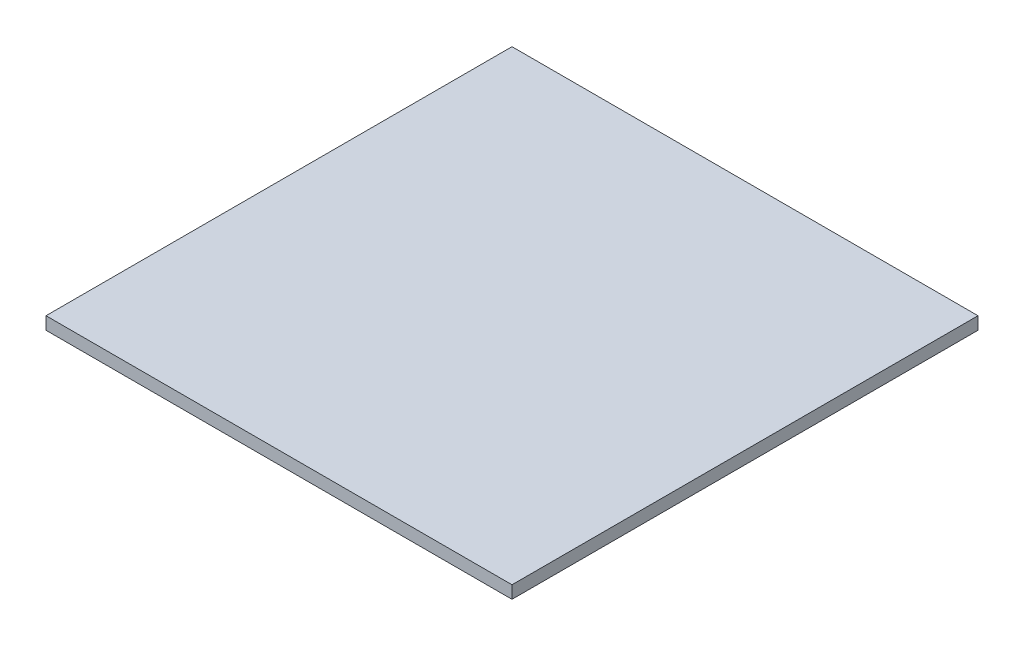
ISO-10303-21;
HEADER;
FILE_DESCRIPTION(('STEP AP214'),'2;1');
FILE_NAME('part.step','',(''),(''),'','','');
FILE_SCHEMA(('AUTOMOTIVE_DESIGN { 1 0 10303 214 1 1 1 1 }'));
ENDSEC;
DATA;
#1=APPLICATION_CONTEXT('core data for automotive mechanical design processes');
#2=APPLICATION_PROTOCOL_DEFINITION('international standard','automotive_design',2000,#1);
#3=PRODUCT_CONTEXT('',#1,'mechanical');
#4=PRODUCT('Part','Part','',(#3));
#5=PRODUCT_RELATED_PRODUCT_CATEGORY('part','',(#4));
#6=PRODUCT_DEFINITION_FORMATION('','',#4);
#7=PRODUCT_DEFINITION_CONTEXT('part definition',#1,'design');
#8=PRODUCT_DEFINITION('design','',#6,#7);
#9=PRODUCT_DEFINITION_SHAPE('','',#8);
#10=(LENGTH_UNIT() NAMED_UNIT(*) SI_UNIT(.MILLI.,.METRE.));
#11=(NAMED_UNIT(*) PLANE_ANGLE_UNIT() SI_UNIT($,.RADIAN.));
#12=(NAMED_UNIT(*) SI_UNIT($,.STERADIAN.) SOLID_ANGLE_UNIT());
#13=UNCERTAINTY_MEASURE_WITH_UNIT(LENGTH_MEASURE(1.E-05),#10,'distance_accuracy_value','');
#14=(GEOMETRIC_REPRESENTATION_CONTEXT(3) GLOBAL_UNCERTAINTY_ASSIGNED_CONTEXT((#13)) GLOBAL_UNIT_ASSIGNED_CONTEXT((#10,
#11,#12)) REPRESENTATION_CONTEXT('',''));
#15=CARTESIAN_POINT('',(0.,0.,0.));
#16=DIRECTION('',(0.,0.,1.));
#17=DIRECTION('',(1.,0.,0.));
#18=AXIS2_PLACEMENT_3D('',#15,#16,#17);
#19=CARTESIAN_POINT('',(-95.25,5.159375,-95.25));
#20=DIRECTION('',(1.,0.,0.));
#21=DIRECTION('',(0.,0.,-1.));
#22=AXIS2_PLACEMENT_3D('',#19,#20,#21);
#23=PLANE('',#22);
#24=DIRECTION('',(0.,0.,1.));
#25=VECTOR('',#24,1.);
#26=CARTESIAN_POINT('',(-95.25,0.,-95.25));
#27=LINE('',#26,#25);
#28=CARTESIAN_POINT('',(-95.25,0.,-95.25));
#29=VERTEX_POINT('',#28);
#30=CARTESIAN_POINT('',(-95.25,0.,95.25));
#31=VERTEX_POINT('',#30);
#32=EDGE_CURVE('E96',#29,#31,#27,.T.);
#33=ORIENTED_EDGE('',*,*,#32,.T.);
#34=DIRECTION('',(0.,-1.,0.));
#35=VECTOR('',#34,1.);
#36=CARTESIAN_POINT('',(-95.25,5.159375,95.25));
#37=LINE('',#36,#35);
#38=CARTESIAN_POINT('',(-95.25,5.159375,95.25));
#39=VERTEX_POINT('',#38);
#40=EDGE_CURVE('E11',#39,#31,#37,.T.);
#41=ORIENTED_EDGE('',*,*,#40,.F.);
#42=DIRECTION('',(0.,0.,1.));
#43=VECTOR('',#42,1.);
#44=CARTESIAN_POINT('',(-95.25,5.159375,-95.25));
#45=LINE('',#44,#43);
#46=CARTESIAN_POINT('',(-95.25,5.159375,-95.25));
#47=VERTEX_POINT('',#46);
#48=EDGE_CURVE('E84',#47,#39,#45,.T.);
#49=ORIENTED_EDGE('',*,*,#48,.F.);
#50=DIRECTION('',(0.,-1.,0.));
#51=VECTOR('',#50,1.);
#52=CARTESIAN_POINT('',(-95.25,5.159375,-95.25));
#53=LINE('',#52,#51);
#54=EDGE_CURVE('E92',#47,#29,#53,.T.);
#55=ORIENTED_EDGE('',*,*,#54,.T.);
#56=EDGE_LOOP('',(#33,#41,#49,#55));
#57=FACE_BOUND('',#56,.T.);
#58=ADVANCED_FACE('F33',(#57),#23,.F.);
#59=CARTESIAN_POINT('',(-95.25,5.159375,95.25));
#60=DIRECTION('',(0.,0.,-1.));
#61=DIRECTION('',(-1.,0.,0.));
#62=AXIS2_PLACEMENT_3D('',#59,#60,#61);
#63=PLANE('',#62);
#64=DIRECTION('',(1.,0.,0.));
#65=VECTOR('',#64,1.);
#66=CARTESIAN_POINT('',(-95.25,0.,95.25));
#67=LINE('',#66,#65);
#68=CARTESIAN_POINT('',(95.25,0.,95.25));
#69=VERTEX_POINT('',#68);
#70=EDGE_CURVE('E88',#31,#69,#67,.T.);
#71=ORIENTED_EDGE('',*,*,#70,.T.);
#72=DIRECTION('',(0.,-1.,0.));
#73=VECTOR('',#72,1.);
#74=CARTESIAN_POINT('',(95.25,5.159375,95.25));
#75=LINE('',#74,#73);
#76=CARTESIAN_POINT('',(95.25,5.159375,95.25));
#77=VERTEX_POINT('',#76);
#78=EDGE_CURVE('E41',#77,#69,#75,.T.);
#79=ORIENTED_EDGE('',*,*,#78,.F.);
#80=DIRECTION('',(1.,0.,0.));
#81=VECTOR('',#80,1.);
#82=CARTESIAN_POINT('',(-95.25,5.159375,95.25));
#83=LINE('',#82,#81);
#84=EDGE_CURVE('E79',#39,#77,#83,.T.);
#85=ORIENTED_EDGE('',*,*,#84,.F.);
#86=ORIENTED_EDGE('',*,*,#40,.T.);
#87=EDGE_LOOP('',(#71,#79,#85,#86));
#88=FACE_BOUND('',#87,.T.);
#89=ADVANCED_FACE('F87',(#88),#63,.F.);
#90=CARTESIAN_POINT('',(95.25,5.159375,-95.25));
#91=DIRECTION('',(-1.,0.,0.));
#92=DIRECTION('',(0.,0.,1.));
#93=AXIS2_PLACEMENT_3D('',#90,#91,#92);
#94=PLANE('',#93);
#95=DIRECTION('',(0.,0.,-1.));
#96=VECTOR('',#95,1.);
#97=CARTESIAN_POINT('',(95.25,0.,-95.25));
#98=LINE('',#97,#96);
#99=CARTESIAN_POINT('',(95.25,0.,-95.25));
#100=VERTEX_POINT('',#99);
#101=EDGE_CURVE('E66',#69,#100,#98,.T.);
#102=ORIENTED_EDGE('',*,*,#101,.T.);
#103=DIRECTION('',(0.,-1.,0.));
#104=VECTOR('',#103,1.);
#105=CARTESIAN_POINT('',(95.25,5.159375,-95.25));
#106=LINE('',#105,#104);
#107=CARTESIAN_POINT('',(95.25,5.159375,-95.25));
#108=VERTEX_POINT('',#107);
#109=EDGE_CURVE('E89',#108,#100,#106,.T.);
#110=ORIENTED_EDGE('',*,*,#109,.F.);
#111=DIRECTION('',(0.,0.,-1.));
#112=VECTOR('',#111,1.);
#113=CARTESIAN_POINT('',(95.25,5.159375,-95.25));
#114=LINE('',#113,#112);
#115=EDGE_CURVE('E82',#77,#108,#114,.T.);
#116=ORIENTED_EDGE('',*,*,#115,.F.);
#117=ORIENTED_EDGE('',*,*,#78,.T.);
#118=EDGE_LOOP('',(#102,#110,#116,#117));
#119=FACE_BOUND('',#118,.T.);
#120=ADVANCED_FACE('F90',(#119),#94,.F.);
#121=CARTESIAN_POINT('',(-95.25,5.159375,-95.25));
#122=DIRECTION('',(0.,0.,1.));
#123=DIRECTION('',(1.,0.,0.));
#124=AXIS2_PLACEMENT_3D('',#121,#122,#123);
#125=PLANE('',#124);
#126=DIRECTION('',(-1.,0.,0.));
#127=VECTOR('',#126,1.);
#128=CARTESIAN_POINT('',(-95.25,0.,-95.25));
#129=LINE('',#128,#127);
#130=EDGE_CURVE('E72',#100,#29,#129,.T.);
#131=ORIENTED_EDGE('',*,*,#130,.T.);
#132=ORIENTED_EDGE('',*,*,#54,.F.);
#133=DIRECTION('',(-1.,0.,0.));
#134=VECTOR('',#133,1.);
#135=CARTESIAN_POINT('',(-95.25,5.159375,-95.25));
#136=LINE('',#135,#134);
#137=EDGE_CURVE('E49',#108,#47,#136,.T.);
#138=ORIENTED_EDGE('',*,*,#137,.F.);
#139=ORIENTED_EDGE('',*,*,#109,.T.);
#140=EDGE_LOOP('',(#131,#132,#138,#139));
#141=FACE_BOUND('',#140,.T.);
#142=ADVANCED_FACE('F103',(#141),#125,.F.);
#143=CARTESIAN_POINT('',(0.,5.159375,0.));
#144=DIRECTION('',(0.,1.,0.));
#145=DIRECTION('',(0.,0.,1.));
#146=AXIS2_PLACEMENT_3D('',#143,#144,#145);
#147=PLANE('',#146);
#148=ORIENTED_EDGE('',*,*,#48,.T.);
#149=ORIENTED_EDGE('',*,*,#84,.T.);
#150=ORIENTED_EDGE('',*,*,#115,.T.);
#151=ORIENTED_EDGE('',*,*,#137,.T.);
#152=EDGE_LOOP('',(#148,#149,#150,#151));
#153=FACE_BOUND('',#152,.T.);
#154=ADVANCED_FACE('F80',(#153),#147,.T.);
#155=CARTESIAN_POINT('',(0.,0.,0.));
#156=DIRECTION('',(0.,1.,0.));
#157=DIRECTION('',(0.,0.,1.));
#158=AXIS2_PLACEMENT_3D('',#155,#156,#157);
#159=PLANE('',#158);
#160=ORIENTED_EDGE('',*,*,#32,.F.);
#161=ORIENTED_EDGE('',*,*,#130,.F.);
#162=ORIENTED_EDGE('',*,*,#101,.F.);
#163=ORIENTED_EDGE('',*,*,#70,.F.);
#164=EDGE_LOOP('',(#160,#161,#162,#163));
#165=FACE_BOUND('',#164,.T.);
#166=ADVANCED_FACE('F106',(#165),#159,.F.);
#167=CLOSED_SHELL('',(#58,#89,#120,#142,#154,#166));
#168=MANIFOLD_SOLID_BREP('B2',#167);
#169=ADVANCED_BREP_SHAPE_REPRESENTATION('',(#18,#168),#14);
#170=SHAPE_DEFINITION_REPRESENTATION(#9,#169);
ENDSEC;
END-ISO-10303-21;
